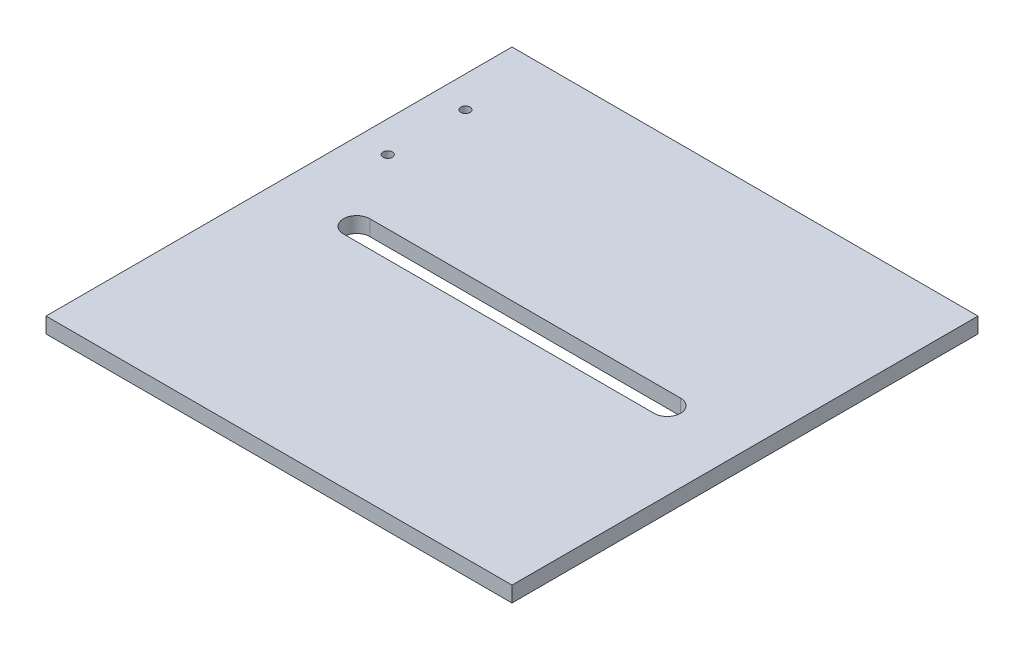
ISO-10303-21;
HEADER;
FILE_DESCRIPTION(('STEP AP214'),'2;1');
FILE_NAME('part.step','',(''),(''),'','','');
FILE_SCHEMA(('AUTOMOTIVE_DESIGN { 1 0 10303 214 1 1 1 1 }'));
ENDSEC;
DATA;
#1=APPLICATION_CONTEXT('core data for automotive mechanical design processes');
#2=APPLICATION_PROTOCOL_DEFINITION('international standard','automotive_design',2000,#1);
#3=PRODUCT_CONTEXT('',#1,'mechanical');
#4=PRODUCT('Part','Part','',(#3));
#5=PRODUCT_RELATED_PRODUCT_CATEGORY('part','',(#4));
#6=PRODUCT_DEFINITION_FORMATION('','',#4);
#7=PRODUCT_DEFINITION_CONTEXT('part definition',#1,'design');
#8=PRODUCT_DEFINITION('design','',#6,#7);
#9=PRODUCT_DEFINITION_SHAPE('','',#8);
#10=(LENGTH_UNIT() NAMED_UNIT(*) SI_UNIT(.MILLI.,.METRE.));
#11=(NAMED_UNIT(*) PLANE_ANGLE_UNIT() SI_UNIT($,.RADIAN.));
#12=(NAMED_UNIT(*) SI_UNIT($,.STERADIAN.) SOLID_ANGLE_UNIT());
#13=UNCERTAINTY_MEASURE_WITH_UNIT(LENGTH_MEASURE(1.E-05),#10,'distance_accuracy_value','');
#14=(GEOMETRIC_REPRESENTATION_CONTEXT(3) GLOBAL_UNCERTAINTY_ASSIGNED_CONTEXT((#13)) GLOBAL_UNIT_ASSIGNED_CONTEXT((#10,
#11,#12)) REPRESENTATION_CONTEXT('',''));
#15=CARTESIAN_POINT('',(0.,0.,0.));
#16=DIRECTION('',(0.,0.,1.));
#17=DIRECTION('',(1.,0.,0.));
#18=AXIS2_PLACEMENT_3D('',#15,#16,#17);
#19=CARTESIAN_POINT('',(0.,5.,0.));
#20=DIRECTION('',(0.,-1.,0.));
#21=DIRECTION('',(0.,0.,-1.));
#22=AXIS2_PLACEMENT_3D('',#19,#20,#21);
#23=PLANE('',#22);
#24=CARTESIAN_POINT('',(9.99999999999999,5.,-125.));
#25=DIRECTION('',(0.,1.,0.));
#26=DIRECTION('',(0.,0.,1.));
#27=AXIS2_PLACEMENT_3D('',#24,#25,#26);
#28=CIRCLE('',#27,1.5);
#29=CARTESIAN_POINT('',(9.99999999999999,5.,-123.5));
#30=VERTEX_POINT('',#29);
#31=EDGE_CURVE('E127',#30,#30,#28,.T.);
#32=ORIENTED_EDGE('',*,*,#31,.F.);
#33=EDGE_LOOP('',(#32));
#34=FACE_BOUND('',#33,.T.);
#35=DIRECTION('',(0.,0.,1.));
#36=VECTOR('',#35,1.);
#37=CARTESIAN_POINT('',(0.,5.,0.));
#38=LINE('',#37,#36);
#39=CARTESIAN_POINT('',(0.,5.,-150.));
#40=VERTEX_POINT('',#39);
#41=CARTESIAN_POINT('',(0.,5.,0.));
#42=VERTEX_POINT('',#41);
#43=EDGE_CURVE('E137',#40,#42,#38,.T.);
#44=ORIENTED_EDGE('',*,*,#43,.T.);
#45=DIRECTION('',(1.,0.,0.));
#46=VECTOR('',#45,1.);
#47=CARTESIAN_POINT('',(0.,5.,0.));
#48=LINE('',#47,#46);
#49=CARTESIAN_POINT('',(150.,5.,0.));
#50=VERTEX_POINT('',#49);
#51=EDGE_CURVE('E140',#42,#50,#48,.T.);
#52=ORIENTED_EDGE('',*,*,#51,.T.);
#53=DIRECTION('',(0.,0.,-1.));
#54=VECTOR('',#53,1.);
#55=CARTESIAN_POINT('',(150.,5.,0.));
#56=LINE('',#55,#54);
#57=CARTESIAN_POINT('',(150.,5.,-150.));
#58=VERTEX_POINT('',#57);
#59=EDGE_CURVE('E143',#50,#58,#56,.T.);
#60=ORIENTED_EDGE('',*,*,#59,.T.);
#61=DIRECTION('',(-1.,0.,0.));
#62=VECTOR('',#61,1.);
#63=CARTESIAN_POINT('',(0.,5.,-150.));
#64=LINE('',#63,#62);
#65=EDGE_CURVE('E145',#58,#40,#64,.T.);
#66=ORIENTED_EDGE('',*,*,#65,.T.);
#67=EDGE_LOOP('',(#44,#52,#60,#66));
#68=FACE_BOUND('',#67,.T.);
#69=CARTESIAN_POINT('',(25.,5.,-75.));
#70=DIRECTION('',(0.,1.,0.));
#71=DIRECTION('',(0.,0.,1.));
#72=AXIS2_PLACEMENT_3D('',#69,#70,#71);
#73=CIRCLE('',#72,4.25);
#74=CARTESIAN_POINT('',(25.,5.,-79.25));
#75=VERTEX_POINT('',#74);
#76=CARTESIAN_POINT('',(25.,5.,-70.75));
#77=VERTEX_POINT('',#76);
#78=EDGE_CURVE('E98',#75,#77,#73,.T.);
#79=ORIENTED_EDGE('',*,*,#78,.F.);
#80=DIRECTION('',(-1.,0.,0.));
#81=VECTOR('',#80,1.);
#82=CARTESIAN_POINT('',(25.,5.,-79.25));
#83=LINE('',#82,#81);
#84=CARTESIAN_POINT('',(125.,5.,-79.25));
#85=VERTEX_POINT('',#84);
#86=EDGE_CURVE('E121',#85,#75,#83,.T.);
#87=ORIENTED_EDGE('',*,*,#86,.F.);
#88=CARTESIAN_POINT('',(125.,5.,-75.));
#89=DIRECTION('',(0.,1.,0.));
#90=DIRECTION('',(0.,0.,-1.));
#91=AXIS2_PLACEMENT_3D('',#88,#89,#90);
#92=CIRCLE('',#91,4.25);
#93=CARTESIAN_POINT('',(125.,5.,-70.75));
#94=VERTEX_POINT('',#93);
#95=EDGE_CURVE('E119',#94,#85,#92,.T.);
#96=ORIENTED_EDGE('',*,*,#95,.F.);
#97=DIRECTION('',(1.,0.,0.));
#98=VECTOR('',#97,1.);
#99=CARTESIAN_POINT('',(25.,5.,-70.75));
#100=LINE('',#99,#98);
#101=EDGE_CURVE('E106',#77,#94,#100,.T.);
#102=ORIENTED_EDGE('',*,*,#101,.F.);
#103=EDGE_LOOP('',(#79,#87,#96,#102));
#104=FACE_BOUND('',#103,.T.);
#105=CARTESIAN_POINT('',(9.99999999999999,5.,-100.));
#106=DIRECTION('',(0.,1.,0.));
#107=DIRECTION('',(0.,0.,1.));
#108=AXIS2_PLACEMENT_3D('',#105,#106,#107);
#109=CIRCLE('',#108,1.5);
#110=CARTESIAN_POINT('',(9.99999999999999,5.,-98.5));
#111=VERTEX_POINT('',#110);
#112=EDGE_CURVE('E228',#111,#111,#109,.T.);
#113=ORIENTED_EDGE('',*,*,#112,.F.);
#114=EDGE_LOOP('',(#113));
#115=FACE_BOUND('',#114,.T.);
#116=ADVANCED_FACE('F33',(#34,#68,#104,#115),#23,.F.);
#117=CARTESIAN_POINT('',(0.,0.,0.));
#118=DIRECTION('',(0.,-1.,0.));
#119=DIRECTION('',(0.,0.,-1.));
#120=AXIS2_PLACEMENT_3D('',#117,#118,#119);
#121=PLANE('',#120);
#122=CARTESIAN_POINT('',(9.99999999999999,0.,-125.));
#123=DIRECTION('',(0.,1.,0.));
#124=DIRECTION('',(0.,0.,1.));
#125=AXIS2_PLACEMENT_3D('',#122,#123,#124);
#126=CIRCLE('',#125,1.5);
#127=CARTESIAN_POINT('',(9.99999999999999,0.,-123.5));
#128=VERTEX_POINT('',#127);
#129=EDGE_CURVE('E234',#128,#128,#126,.T.);
#130=ORIENTED_EDGE('',*,*,#129,.T.);
#131=EDGE_LOOP('',(#130));
#132=FACE_BOUND('',#131,.T.);
#133=DIRECTION('',(0.,0.,1.));
#134=VECTOR('',#133,1.);
#135=CARTESIAN_POINT('',(0.,0.,0.));
#136=LINE('',#135,#134);
#137=CARTESIAN_POINT('',(0.,0.,-150.));
#138=VERTEX_POINT('',#137);
#139=CARTESIAN_POINT('',(0.,0.,0.));
#140=VERTEX_POINT('',#139);
#141=EDGE_CURVE('E114',#138,#140,#136,.T.);
#142=ORIENTED_EDGE('',*,*,#141,.F.);
#143=DIRECTION('',(-1.,0.,0.));
#144=VECTOR('',#143,1.);
#145=CARTESIAN_POINT('',(0.,0.,-150.));
#146=LINE('',#145,#144);
#147=CARTESIAN_POINT('',(150.,0.,-150.));
#148=VERTEX_POINT('',#147);
#149=EDGE_CURVE('E141',#148,#138,#146,.T.);
#150=ORIENTED_EDGE('',*,*,#149,.F.);
#151=DIRECTION('',(0.,0.,-1.));
#152=VECTOR('',#151,1.);
#153=CARTESIAN_POINT('',(150.,0.,0.));
#154=LINE('',#153,#152);
#155=CARTESIAN_POINT('',(150.,0.,0.));
#156=VERTEX_POINT('',#155);
#157=EDGE_CURVE('E152',#156,#148,#154,.T.);
#158=ORIENTED_EDGE('',*,*,#157,.F.);
#159=DIRECTION('',(1.,0.,0.));
#160=VECTOR('',#159,1.);
#161=CARTESIAN_POINT('',(0.,0.,0.));
#162=LINE('',#161,#160);
#163=EDGE_CURVE('E150',#140,#156,#162,.T.);
#164=ORIENTED_EDGE('',*,*,#163,.F.);
#165=EDGE_LOOP('',(#142,#150,#158,#164));
#166=FACE_BOUND('',#165,.T.);
#167=DIRECTION('',(-1.,0.,0.));
#168=VECTOR('',#167,1.);
#169=CARTESIAN_POINT('',(25.,0.,-79.25));
#170=LINE('',#169,#168);
#171=CARTESIAN_POINT('',(125.,0.,-79.25));
#172=VERTEX_POINT('',#171);
#173=CARTESIAN_POINT('',(25.,0.,-79.25));
#174=VERTEX_POINT('',#173);
#175=EDGE_CURVE('E107',#172,#174,#170,.T.);
#176=ORIENTED_EDGE('',*,*,#175,.T.);
#177=CARTESIAN_POINT('',(25.,0.,-75.));
#178=DIRECTION('',(0.,1.,0.));
#179=DIRECTION('',(0.,0.,1.));
#180=AXIS2_PLACEMENT_3D('',#177,#178,#179);
#181=CIRCLE('',#180,4.25);
#182=CARTESIAN_POINT('',(25.,0.,-70.75));
#183=VERTEX_POINT('',#182);
#184=EDGE_CURVE('E56',#174,#183,#181,.T.);
#185=ORIENTED_EDGE('',*,*,#184,.T.);
#186=DIRECTION('',(1.,0.,0.));
#187=VECTOR('',#186,1.);
#188=CARTESIAN_POINT('',(25.,0.,-70.75));
#189=LINE('',#188,#187);
#190=CARTESIAN_POINT('',(125.,0.,-70.75));
#191=VERTEX_POINT('',#190);
#192=EDGE_CURVE('E113',#183,#191,#189,.T.);
#193=ORIENTED_EDGE('',*,*,#192,.T.);
#194=CARTESIAN_POINT('',(125.,0.,-75.));
#195=DIRECTION('',(0.,1.,0.));
#196=DIRECTION('',(0.,0.,-1.));
#197=AXIS2_PLACEMENT_3D('',#194,#195,#196);
#198=CIRCLE('',#197,4.25);
#199=EDGE_CURVE('E129',#191,#172,#198,.T.);
#200=ORIENTED_EDGE('',*,*,#199,.T.);
#201=EDGE_LOOP('',(#176,#185,#193,#200));
#202=FACE_BOUND('',#201,.T.);
#203=CARTESIAN_POINT('',(9.99999999999999,0.,-100.));
#204=DIRECTION('',(0.,1.,0.));
#205=DIRECTION('',(0.,0.,1.));
#206=AXIS2_PLACEMENT_3D('',#203,#204,#205);
#207=CIRCLE('',#206,1.5);
#208=CARTESIAN_POINT('',(9.99999999999999,0.,-98.5));
#209=VERTEX_POINT('',#208);
#210=EDGE_CURVE('E231',#209,#209,#207,.T.);
#211=ORIENTED_EDGE('',*,*,#210,.T.);
#212=EDGE_LOOP('',(#211));
#213=FACE_BOUND('',#212,.T.);
#214=ADVANCED_FACE('F170',(#132,#166,#202,#213),#121,.T.);
#215=CARTESIAN_POINT('',(0.,5.,0.));
#216=DIRECTION('',(1.,0.,0.));
#217=DIRECTION('',(0.,0.,-1.));
#218=AXIS2_PLACEMENT_3D('',#215,#216,#217);
#219=PLANE('',#218);
#220=ORIENTED_EDGE('',*,*,#141,.T.);
#221=DIRECTION('',(0.,-1.,0.));
#222=VECTOR('',#221,1.);
#223=CARTESIAN_POINT('',(0.,5.,0.));
#224=LINE('',#223,#222);
#225=EDGE_CURVE('E11',#42,#140,#224,.T.);
#226=ORIENTED_EDGE('',*,*,#225,.F.);
#227=ORIENTED_EDGE('',*,*,#43,.F.);
#228=DIRECTION('',(0.,-1.,0.));
#229=VECTOR('',#228,1.);
#230=CARTESIAN_POINT('',(0.,5.,-150.));
#231=LINE('',#230,#229);
#232=EDGE_CURVE('E147',#40,#138,#231,.T.);
#233=ORIENTED_EDGE('',*,*,#232,.T.);
#234=EDGE_LOOP('',(#220,#226,#227,#233));
#235=FACE_BOUND('',#234,.T.);
#236=ADVANCED_FACE('F35',(#235),#219,.F.);
#237=CARTESIAN_POINT('',(0.,5.,0.));
#238=DIRECTION('',(0.,0.,-1.));
#239=DIRECTION('',(-1.,0.,0.));
#240=AXIS2_PLACEMENT_3D('',#237,#238,#239);
#241=PLANE('',#240);
#242=ORIENTED_EDGE('',*,*,#163,.T.);
#243=DIRECTION('',(0.,-1.,0.));
#244=VECTOR('',#243,1.);
#245=CARTESIAN_POINT('',(150.,5.,0.));
#246=LINE('',#245,#244);
#247=EDGE_CURVE('E41',#50,#156,#246,.T.);
#248=ORIENTED_EDGE('',*,*,#247,.F.);
#249=ORIENTED_EDGE('',*,*,#51,.F.);
#250=ORIENTED_EDGE('',*,*,#225,.T.);
#251=EDGE_LOOP('',(#242,#248,#249,#250));
#252=FACE_BOUND('',#251,.T.);
#253=ADVANCED_FACE('F180',(#252),#241,.F.);
#254=CARTESIAN_POINT('',(150.,5.,0.));
#255=DIRECTION('',(-1.,0.,0.));
#256=DIRECTION('',(0.,0.,1.));
#257=AXIS2_PLACEMENT_3D('',#254,#255,#256);
#258=PLANE('',#257);
#259=ORIENTED_EDGE('',*,*,#157,.T.);
#260=DIRECTION('',(0.,-1.,0.));
#261=VECTOR('',#260,1.);
#262=CARTESIAN_POINT('',(150.,5.,-150.));
#263=LINE('',#262,#261);
#264=EDGE_CURVE('E157',#58,#148,#263,.T.);
#265=ORIENTED_EDGE('',*,*,#264,.F.);
#266=ORIENTED_EDGE('',*,*,#59,.F.);
#267=ORIENTED_EDGE('',*,*,#247,.T.);
#268=EDGE_LOOP('',(#259,#265,#266,#267));
#269=FACE_BOUND('',#268,.T.);
#270=ADVANCED_FACE('F164',(#269),#258,.F.);
#271=CARTESIAN_POINT('',(0.,5.,-150.));
#272=DIRECTION('',(0.,0.,1.));
#273=DIRECTION('',(1.,0.,0.));
#274=AXIS2_PLACEMENT_3D('',#271,#272,#273);
#275=PLANE('',#274);
#276=ORIENTED_EDGE('',*,*,#149,.T.);
#277=ORIENTED_EDGE('',*,*,#232,.F.);
#278=ORIENTED_EDGE('',*,*,#65,.F.);
#279=ORIENTED_EDGE('',*,*,#264,.T.);
#280=EDGE_LOOP('',(#276,#277,#278,#279));
#281=FACE_BOUND('',#280,.T.);
#282=ADVANCED_FACE('F174',(#281),#275,.F.);
#283=CARTESIAN_POINT('',(25.,5.,-75.));
#284=DIRECTION('',(0.,-1.,0.));
#285=DIRECTION('',(0.,0.,-1.));
#286=AXIS2_PLACEMENT_3D('',#283,#284,#285);
#287=CYLINDRICAL_SURFACE('',#286,4.25);
#288=ORIENTED_EDGE('',*,*,#184,.F.);
#289=DIRECTION('',(0.,-1.,0.));
#290=VECTOR('',#289,1.);
#291=CARTESIAN_POINT('',(25.,5.,-79.25));
#292=LINE('',#291,#290);
#293=EDGE_CURVE('E102',#75,#174,#292,.T.);
#294=ORIENTED_EDGE('',*,*,#293,.F.);
#295=ORIENTED_EDGE('',*,*,#78,.T.);
#296=DIRECTION('',(0.,-1.,0.));
#297=VECTOR('',#296,1.);
#298=CARTESIAN_POINT('',(25.,5.,-70.75));
#299=LINE('',#298,#297);
#300=EDGE_CURVE('E101',#77,#183,#299,.T.);
#301=ORIENTED_EDGE('',*,*,#300,.T.);
#302=EDGE_LOOP('',(#288,#294,#295,#301));
#303=FACE_BOUND('',#302,.T.);
#304=ADVANCED_FACE('F100',(#303),#287,.F.);
#305=CARTESIAN_POINT('',(25.,5.,-70.75));
#306=DIRECTION('',(0.,0.,-1.));
#307=DIRECTION('',(-1.,0.,0.));
#308=AXIS2_PLACEMENT_3D('',#305,#306,#307);
#309=PLANE('',#308);
#310=ORIENTED_EDGE('',*,*,#192,.F.);
#311=ORIENTED_EDGE('',*,*,#300,.F.);
#312=ORIENTED_EDGE('',*,*,#101,.T.);
#313=DIRECTION('',(0.,-1.,0.));
#314=VECTOR('',#313,1.);
#315=CARTESIAN_POINT('',(125.,5.,-70.75));
#316=LINE('',#315,#314);
#317=EDGE_CURVE('E115',#94,#191,#316,.T.);
#318=ORIENTED_EDGE('',*,*,#317,.T.);
#319=EDGE_LOOP('',(#310,#311,#312,#318));
#320=FACE_BOUND('',#319,.T.);
#321=ADVANCED_FACE('F110',(#320),#309,.T.);
#322=CARTESIAN_POINT('',(125.,5.,-75.));
#323=DIRECTION('',(0.,-1.,0.));
#324=DIRECTION('',(0.,0.,-1.));
#325=AXIS2_PLACEMENT_3D('',#322,#323,#324);
#326=CYLINDRICAL_SURFACE('',#325,4.25);
#327=ORIENTED_EDGE('',*,*,#199,.F.);
#328=ORIENTED_EDGE('',*,*,#317,.F.);
#329=ORIENTED_EDGE('',*,*,#95,.T.);
#330=DIRECTION('',(0.,-1.,0.));
#331=VECTOR('',#330,1.);
#332=CARTESIAN_POINT('',(125.,5.,-79.25));
#333=LINE('',#332,#331);
#334=EDGE_CURVE('E48',#85,#172,#333,.T.);
#335=ORIENTED_EDGE('',*,*,#334,.T.);
#336=EDGE_LOOP('',(#327,#328,#329,#335));
#337=FACE_BOUND('',#336,.T.);
#338=ADVANCED_FACE('F206',(#337),#326,.F.);
#339=CARTESIAN_POINT('',(25.,5.,-79.25));
#340=DIRECTION('',(0.,0.,1.));
#341=DIRECTION('',(1.,0.,0.));
#342=AXIS2_PLACEMENT_3D('',#339,#340,#341);
#343=PLANE('',#342);
#344=ORIENTED_EDGE('',*,*,#175,.F.);
#345=ORIENTED_EDGE('',*,*,#334,.F.);
#346=ORIENTED_EDGE('',*,*,#86,.T.);
#347=ORIENTED_EDGE('',*,*,#293,.T.);
#348=EDGE_LOOP('',(#344,#345,#346,#347));
#349=FACE_BOUND('',#348,.T.);
#350=ADVANCED_FACE('F210',(#349),#343,.T.);
#351=CARTESIAN_POINT('',(9.99999999999999,5.,-125.));
#352=DIRECTION('',(0.,-1.,0.));
#353=DIRECTION('',(0.,0.,-1.));
#354=AXIS2_PLACEMENT_3D('',#351,#352,#353);
#355=CYLINDRICAL_SURFACE('',#354,1.5);
#356=ORIENTED_EDGE('',*,*,#31,.T.);
#357=EDGE_LOOP('',(#356));
#358=FACE_BOUND('',#357,.T.);
#359=ORIENTED_EDGE('',*,*,#129,.F.);
#360=EDGE_LOOP('',(#359));
#361=FACE_BOUND('',#360,.T.);
#362=ADVANCED_FACE('F216',(#358,#361),#355,.F.);
#363=CARTESIAN_POINT('',(9.99999999999999,5.,-100.));
#364=DIRECTION('',(0.,-1.,0.));
#365=DIRECTION('',(0.,0.,-1.));
#366=AXIS2_PLACEMENT_3D('',#363,#364,#365);
#367=CYLINDRICAL_SURFACE('',#366,1.5);
#368=ORIENTED_EDGE('',*,*,#112,.T.);
#369=EDGE_LOOP('',(#368));
#370=FACE_BOUND('',#369,.T.);
#371=ORIENTED_EDGE('',*,*,#210,.F.);
#372=EDGE_LOOP('',(#371));
#373=FACE_BOUND('',#372,.T.);
#374=ADVANCED_FACE('F219',(#370,#373),#367,.F.);
#375=CLOSED_SHELL('',(#116,#214,#236,#253,#270,#282,#304,#321,#338,#350,#362,#374));
#376=MANIFOLD_SOLID_BREP('B2',#375);
#377=ADVANCED_BREP_SHAPE_REPRESENTATION('',(#18,#376),#14);
#378=SHAPE_DEFINITION_REPRESENTATION(#9,#377);
ENDSEC;
END-ISO-10303-21;
